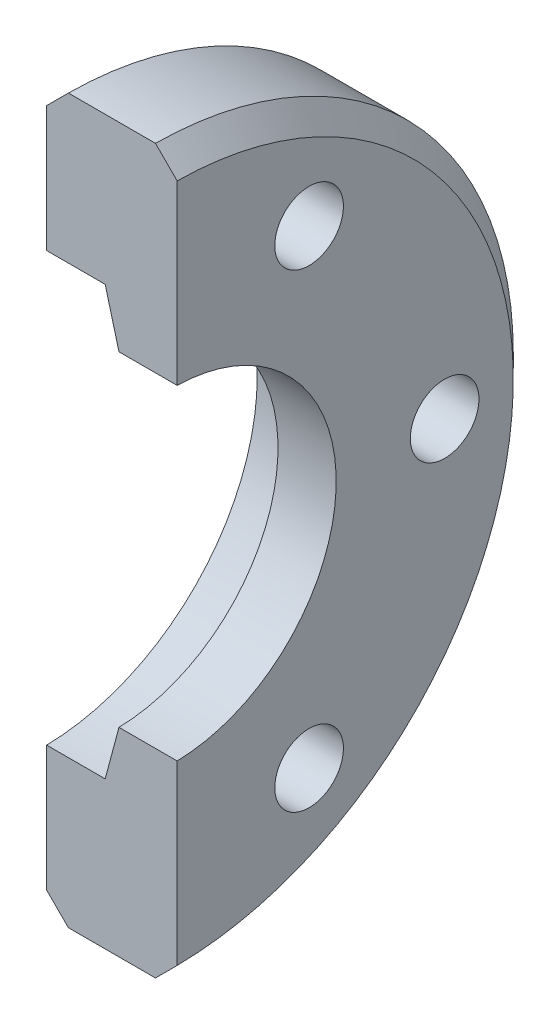
ISO-10303-21;
HEADER;
FILE_DESCRIPTION(('STEP AP214'),'2;1');
FILE_NAME('part.step','',(''),(''),'','','');
FILE_SCHEMA(('AUTOMOTIVE_DESIGN { 1 0 10303 214 1 1 1 1 }'));
ENDSEC;
DATA;
#1=APPLICATION_CONTEXT('core data for automotive mechanical design processes');
#2=APPLICATION_PROTOCOL_DEFINITION('international standard','automotive_design',2000,#1);
#3=PRODUCT_CONTEXT('',#1,'mechanical');
#4=PRODUCT('Part','Part','',(#3));
#5=PRODUCT_RELATED_PRODUCT_CATEGORY('part','',(#4));
#6=PRODUCT_DEFINITION_FORMATION('','',#4);
#7=PRODUCT_DEFINITION_CONTEXT('part definition',#1,'design');
#8=PRODUCT_DEFINITION('design','',#6,#7);
#9=PRODUCT_DEFINITION_SHAPE('','',#8);
#10=(LENGTH_UNIT() NAMED_UNIT(*) SI_UNIT(.MILLI.,.METRE.));
#11=(NAMED_UNIT(*) PLANE_ANGLE_UNIT() SI_UNIT($,.RADIAN.));
#12=(NAMED_UNIT(*) SI_UNIT($,.STERADIAN.) SOLID_ANGLE_UNIT());
#13=UNCERTAINTY_MEASURE_WITH_UNIT(LENGTH_MEASURE(1.E-05),#10,'distance_accuracy_value','');
#14=(GEOMETRIC_REPRESENTATION_CONTEXT(3) GLOBAL_UNCERTAINTY_ASSIGNED_CONTEXT((#13)) GLOBAL_UNIT_ASSIGNED_CONTEXT((#10,
#11,#12)) REPRESENTATION_CONTEXT('',''));
#15=CARTESIAN_POINT('',(0.,0.,0.));
#16=DIRECTION('',(0.,0.,1.));
#17=DIRECTION('',(1.,0.,0.));
#18=AXIS2_PLACEMENT_3D('',#15,#16,#17);
#19=CARTESIAN_POINT('',(0.,23.876,0.));
#20=DIRECTION('',(1.,0.,0.));
#21=DIRECTION('',(0.,0.,-1.));
#22=AXIS2_PLACEMENT_3D('',#19,#20,#21);
#23=PLANE('',#22);
#24=CARTESIAN_POINT('',(0.,0.,-19.05));
#25=DIRECTION('',(1.,0.,0.));
#26=DIRECTION('',(0.,1.,0.));
#27=AXIS2_PLACEMENT_3D('',#24,#25,#26);
#28=CIRCLE('',#27,2.413);
#29=CARTESIAN_POINT('',(0.,2.41299999999999,-19.05));
#30=VERTEX_POINT('',#29);
#31=EDGE_CURVE('E11',#30,#30,#28,.T.);
#32=ORIENTED_EDGE('',*,*,#31,.T.);
#33=EDGE_LOOP('',(#32));
#34=FACE_BOUND('',#33,.T.);
#35=CARTESIAN_POINT('',(0.,16.497783942094,-9.525));
#36=DIRECTION('',(1.,0.,0.));
#37=DIRECTION('',(0.,1.,0.));
#38=AXIS2_PLACEMENT_3D('',#35,#36,#37);
#39=CIRCLE('',#38,2.413);
#40=CARTESIAN_POINT('',(0.,18.910783942094,-9.525));
#41=VERTEX_POINT('',#40);
#42=EDGE_CURVE('E26',#41,#41,#39,.T.);
#43=ORIENTED_EDGE('',*,*,#42,.T.);
#44=EDGE_LOOP('',(#43));
#45=FACE_BOUND('',#44,.T.);
#46=CARTESIAN_POINT('',(0.,-16.497783942094,-9.525));
#47=DIRECTION('',(1.,0.,0.));
#48=DIRECTION('',(0.,1.,0.));
#49=AXIS2_PLACEMENT_3D('',#46,#47,#48);
#50=CIRCLE('',#49,2.413);
#51=CARTESIAN_POINT('',(0.,-14.084783942094,-9.525));
#52=VERTEX_POINT('',#51);
#53=EDGE_CURVE('E183',#52,#52,#50,.T.);
#54=ORIENTED_EDGE('',*,*,#53,.T.);
#55=EDGE_LOOP('',(#54));
#56=FACE_BOUND('',#55,.T.);
#57=DIRECTION('',(0.,-1.,0.));
#58=VECTOR('',#57,1.);
#59=CARTESIAN_POINT('',(0.,23.876,-0.254));
#60=LINE('',#59,#58);
#61=CARTESIAN_POINT('',(0.,23.8746488979419,-0.254));
#62=VERTEX_POINT('',#61);
#63=CARTESIAN_POINT('',(0.,15.047356387419,-0.254));
#64=VERTEX_POINT('',#63);
#65=EDGE_CURVE('E35',#62,#64,#60,.T.);
#66=ORIENTED_EDGE('',*,*,#65,.F.);
#67=CARTESIAN_POINT('',(0.,0.,0.));
#68=DIRECTION('',(-1.,0.,0.));
#69=DIRECTION('',(0.,0.,1.));
#70=AXIS2_PLACEMENT_3D('',#67,#68,#69);
#71=CIRCLE('',#70,23.876);
#72=CARTESIAN_POINT('',(0.,-23.8746488979419,-0.254));
#73=VERTEX_POINT('',#72);
#74=EDGE_CURVE('E124',#62,#73,#71,.T.);
#75=ORIENTED_EDGE('',*,*,#74,.T.);
#76=DIRECTION('',(0.,-1.,0.));
#77=VECTOR('',#76,1.);
#78=CARTESIAN_POINT('',(0.,23.876,-0.254));
#79=LINE('',#78,#77);
#80=CARTESIAN_POINT('',(0.,-15.047356387419,-0.254));
#81=VERTEX_POINT('',#80);
#82=EDGE_CURVE('E117',#81,#73,#79,.T.);
#83=ORIENTED_EDGE('',*,*,#82,.F.);
#84=CARTESIAN_POINT('',(0.,0.,0.));
#85=DIRECTION('',(-1.,0.,0.));
#86=DIRECTION('',(0.,0.,1.));
#87=AXIS2_PLACEMENT_3D('',#84,#85,#86);
#88=CIRCLE('',#87,15.0495);
#89=EDGE_CURVE('E126',#64,#81,#88,.T.);
#90=ORIENTED_EDGE('',*,*,#89,.F.);
#91=EDGE_LOOP('',(#66,#75,#83,#90));
#92=FACE_BOUND('',#91,.T.);
#93=ADVANCED_FACE('F16',(#34,#45,#56,#92),#23,.F.);
#94=CARTESIAN_POINT('',(-50.8,50.8,-0.254));
#95=DIRECTION('',(0.,0.,1.));
#96=DIRECTION('',(1.,0.,0.));
#97=AXIS2_PLACEMENT_3D('',#94,#95,#96);
#98=PLANE('',#97);
#99=DIRECTION('',(1.,0.,0.));
#100=VECTOR('',#99,1.);
#101=CARTESIAN_POINT('',(9.1694,15.047356387419,-0.254));
#102=LINE('',#101,#100);
#103=CARTESIAN_POINT('',(4.1101578979956,15.047356387419,-0.254));
#104=VERTEX_POINT('',#103);
#105=EDGE_CURVE('E131',#64,#104,#102,.T.);
#106=ORIENTED_EDGE('',*,*,#105,.T.);
#107=CARTESIAN_POINT('',(4.11015789799561,15.047356387419,-0.254));
#108=CARTESIAN_POINT('',(4.43345221536625,13.8406336866748,-0.254));
#109=CARTESIAN_POINT('',(4.75673722811473,12.6339085132271,-0.254));
#110=CARTESIAN_POINT('',(5.08,11.4271774292692,-0.254));
#111=B_SPLINE_CURVE_WITH_KNOTS('',3,(#107,#108,#109,#110),.UNSPECIFIED.,.F.,.F.,(4,4),
(0.0187084762179341,0.0224563066389064),.UNSPECIFIED.);
#112=CARTESIAN_POINT('',(5.08,11.4271774292692,-0.254));
#113=VERTEX_POINT('',#112);
#114=EDGE_CURVE('E134',#104,#113,#111,.T.);
#115=ORIENTED_EDGE('',*,*,#114,.T.);
#116=DIRECTION('',(1.,0.,0.));
#117=VECTOR('',#116,1.);
#118=CARTESIAN_POINT('',(9.1694,11.4271774292692,-0.254));
#119=LINE('',#118,#117);
#120=CARTESIAN_POINT('',(9.1694,11.4271774292692,-0.254));
#121=VERTEX_POINT('',#120);
#122=EDGE_CURVE('E139',#113,#121,#119,.T.);
#123=ORIENTED_EDGE('',*,*,#122,.T.);
#124=DIRECTION('',(0.,1.,0.));
#125=VECTOR('',#124,1.);
#126=CARTESIAN_POINT('',(9.1694,11.43,-0.254));
#127=LINE('',#126,#125);
#128=CARTESIAN_POINT('',(9.1694,23.8746488979419,-0.254));
#129=VERTEX_POINT('',#128);
#130=EDGE_CURVE('E114',#121,#129,#127,.T.);
#131=ORIENTED_EDGE('',*,*,#130,.T.);
#132=DIRECTION('',(-0.707086773354906,0.707126788452077,0.));
#133=VECTOR('',#132,1.);
#134=CARTESIAN_POINT('',(8.40740062748683,24.6366900605401,-0.254));
#135=LINE('',#134,#133);
#136=CARTESIAN_POINT('',(7.6454,25.3987299682484,-0.254));
#137=VERTEX_POINT('',#136);
#138=EDGE_CURVE('E112',#129,#137,#135,.T.);
#139=ORIENTED_EDGE('',*,*,#138,.T.);
#140=DIRECTION('',(-1.,0.,0.));
#141=VECTOR('',#140,1.);
#142=CARTESIAN_POINT('',(9.1694,25.3987299682484,-0.254));
#143=LINE('',#142,#141);
#144=CARTESIAN_POINT('',(1.524,25.3987299682484,-0.254));
#145=VERTEX_POINT('',#144);
#146=EDGE_CURVE('E102',#137,#145,#143,.T.);
#147=ORIENTED_EDGE('',*,*,#146,.T.);
#148=DIRECTION('',(-0.707089102412087,-0.707124459519022,0.));
#149=VECTOR('',#148,1.);
#150=CARTESIAN_POINT('',(0.761999372515258,24.6366900605422,-0.254));
#151=LINE('',#150,#149);
#152=EDGE_CURVE('E115',#145,#62,#151,.T.);
#153=ORIENTED_EDGE('',*,*,#152,.T.);
#154=ORIENTED_EDGE('',*,*,#65,.T.);
#155=EDGE_LOOP('',(#106,#115,#123,#131,#139,#147,#153,#154));
#156=FACE_BOUND('',#155,.T.);
#157=ADVANCED_FACE('F181',(#156),#98,.T.);
#158=CARTESIAN_POINT('',(4.1101578979956,0.,0.));
#159=DIRECTION('',(-1.,0.,0.));
#160=DIRECTION('',(0.,0.,1.));
#161=AXIS2_PLACEMENT_3D('',#158,#159,#160);
#162=CONICAL_SURFACE('',#161,15.0495,1.30899693899576);
#163=ORIENTED_EDGE('',*,*,#114,.F.);
#164=CARTESIAN_POINT('',(4.1101578979956,0.,0.));
#165=DIRECTION('',(-1.,0.,0.));
#166=DIRECTION('',(0.,0.,1.));
#167=AXIS2_PLACEMENT_3D('',#164,#165,#166);
#168=CIRCLE('',#167,15.0495);
#169=CARTESIAN_POINT('',(4.1101578979956,-15.047356387419,-0.254));
#170=VERTEX_POINT('',#169);
#171=EDGE_CURVE('E129',#104,#170,#168,.T.);
#172=ORIENTED_EDGE('',*,*,#171,.T.);
#173=CARTESIAN_POINT('',(5.08,-11.4271774292692,-0.254));
#174=CARTESIAN_POINT('',(4.75673722679854,-12.6339085181404,-0.254));
#175=CARTESIAN_POINT('',(4.43345221436652,-13.8406336904064,-0.254));
#176=CARTESIAN_POINT('',(4.11015789799561,-15.047356387419,-0.254));
#177=B_SPLINE_CURVE_WITH_KNOTS('',3,(#173,#174,#175,#176),.UNSPECIFIED.,.F.,.F.,(4,4),
(0.0459629505750064,0.0496729072252077),.UNSPECIFIED.);
#178=CARTESIAN_POINT('',(5.08,-11.4271774292692,-0.254));
#179=VERTEX_POINT('',#178);
#180=EDGE_CURVE('E150',#179,#170,#177,.T.);
#181=ORIENTED_EDGE('',*,*,#180,.F.);
#182=CARTESIAN_POINT('',(5.08,0.,0.));
#183=DIRECTION('',(-1.,0.,0.));
#184=DIRECTION('',(0.,0.,1.));
#185=AXIS2_PLACEMENT_3D('',#182,#183,#184);
#186=CIRCLE('',#185,11.43);
#187=EDGE_CURVE('E120',#113,#179,#186,.T.);
#188=ORIENTED_EDGE('',*,*,#187,.F.);
#189=EDGE_LOOP('',(#163,#172,#181,#188));
#190=FACE_BOUND('',#189,.T.);
#191=ADVANCED_FACE('F174',(#190),#162,.F.);
#192=CARTESIAN_POINT('',(9.1694,0.,0.));
#193=DIRECTION('',(1.,0.,0.));
#194=DIRECTION('',(0.,0.,1.));
#195=AXIS2_PLACEMENT_3D('',#192,#193,#194);
#196=CYLINDRICAL_SURFACE('',#195,15.0495);
#197=ORIENTED_EDGE('',*,*,#105,.F.);
#198=ORIENTED_EDGE('',*,*,#89,.T.);
#199=DIRECTION('',(-1.,0.,0.));
#200=VECTOR('',#199,1.);
#201=CARTESIAN_POINT('',(9.1694,-15.047356387419,-0.254));
#202=LINE('',#201,#200);
#203=EDGE_CURVE('E118',#170,#81,#202,.T.);
#204=ORIENTED_EDGE('',*,*,#203,.F.);
#205=ORIENTED_EDGE('',*,*,#171,.F.);
#206=EDGE_LOOP('',(#197,#198,#204,#205));
#207=FACE_BOUND('',#206,.T.);
#208=ADVANCED_FACE('F179',(#207),#196,.F.);
#209=CARTESIAN_POINT('',(1.524,0.,0.));
#210=DIRECTION('',(1.,0.,0.));
#211=DIRECTION('',(0.,0.,-1.));
#212=AXIS2_PLACEMENT_3D('',#209,#210,#211);
#213=CONICAL_SURFACE('',#212,25.4,0.785398163397448);
#214=ORIENTED_EDGE('',*,*,#152,.F.);
#215=CARTESIAN_POINT('',(1.524,0.,0.));
#216=DIRECTION('',(-1.,0.,0.));
#217=DIRECTION('',(0.,0.,1.));
#218=AXIS2_PLACEMENT_3D('',#215,#216,#217);
#219=CIRCLE('',#218,25.4);
#220=CARTESIAN_POINT('',(1.524,-25.3987299682484,-0.254));
#221=VERTEX_POINT('',#220);
#222=EDGE_CURVE('E130',#145,#221,#219,.T.);
#223=ORIENTED_EDGE('',*,*,#222,.T.);
#224=DIRECTION('',(0.707086773354903,-0.70712678845208,0.));
#225=VECTOR('',#224,1.);
#226=CARTESIAN_POINT('',(0.761999372513166,-24.6366900605401,-0.254));
#227=LINE('',#226,#225);
#228=EDGE_CURVE('E95',#73,#221,#227,.T.);
#229=ORIENTED_EDGE('',*,*,#228,.F.);
#230=ORIENTED_EDGE('',*,*,#74,.F.);
#231=EDGE_LOOP('',(#214,#223,#229,#230));
#232=FACE_BOUND('',#231,.T.);
#233=ADVANCED_FACE('F216',(#232),#213,.T.);
#234=CARTESIAN_POINT('',(9.1694,11.43,0.));
#235=DIRECTION('',(-1.,0.,0.));
#236=DIRECTION('',(0.,0.,1.));
#237=AXIS2_PLACEMENT_3D('',#234,#235,#236);
#238=PLANE('',#237);
#239=CARTESIAN_POINT('',(9.1694,0.,-19.05));
#240=DIRECTION('',(1.,0.,0.));
#241=DIRECTION('',(0.,1.,0.));
#242=AXIS2_PLACEMENT_3D('',#239,#240,#241);
#243=CIRCLE('',#242,2.413);
#244=CARTESIAN_POINT('',(9.1694,2.41299999999999,-19.05));
#245=VERTEX_POINT('',#244);
#246=EDGE_CURVE('E107',#245,#245,#243,.T.);
#247=ORIENTED_EDGE('',*,*,#246,.F.);
#248=EDGE_LOOP('',(#247));
#249=FACE_BOUND('',#248,.T.);
#250=CARTESIAN_POINT('',(9.1694,16.497783942094,-9.525));
#251=DIRECTION('',(1.,0.,0.));
#252=DIRECTION('',(0.,1.,0.));
#253=AXIS2_PLACEMENT_3D('',#250,#251,#252);
#254=CIRCLE('',#253,2.413);
#255=CARTESIAN_POINT('',(9.1694,18.910783942094,-9.525));
#256=VERTEX_POINT('',#255);
#257=EDGE_CURVE('E104',#256,#256,#254,.T.);
#258=ORIENTED_EDGE('',*,*,#257,.F.);
#259=EDGE_LOOP('',(#258));
#260=FACE_BOUND('',#259,.T.);
#261=CARTESIAN_POINT('',(9.1694,-16.497783942094,-9.525));
#262=DIRECTION('',(1.,0.,0.));
#263=DIRECTION('',(0.,1.,0.));
#264=AXIS2_PLACEMENT_3D('',#261,#262,#263);
#265=CIRCLE('',#264,2.413);
#266=CARTESIAN_POINT('',(9.1694,-14.084783942094,-9.525));
#267=VERTEX_POINT('',#266);
#268=EDGE_CURVE('E155',#267,#267,#265,.T.);
#269=ORIENTED_EDGE('',*,*,#268,.F.);
#270=EDGE_LOOP('',(#269));
#271=FACE_BOUND('',#270,.T.);
#272=DIRECTION('',(0.,1.,0.));
#273=VECTOR('',#272,1.);
#274=CARTESIAN_POINT('',(9.1694,11.43,-0.254));
#275=LINE('',#274,#273);
#276=CARTESIAN_POINT('',(9.1694,-23.8746488979419,-0.254));
#277=VERTEX_POINT('',#276);
#278=CARTESIAN_POINT('',(9.1694,-11.4271774292692,-0.254));
#279=VERTEX_POINT('',#278);
#280=EDGE_CURVE('E80',#277,#279,#275,.T.);
#281=ORIENTED_EDGE('',*,*,#280,.F.);
#282=CARTESIAN_POINT('',(9.1694,0.,0.));
#283=DIRECTION('',(-1.,0.,0.));
#284=DIRECTION('',(0.,0.,1.));
#285=AXIS2_PLACEMENT_3D('',#282,#283,#284);
#286=CIRCLE('',#285,23.876);
#287=EDGE_CURVE('E89',#129,#277,#286,.T.);
#288=ORIENTED_EDGE('',*,*,#287,.F.);
#289=ORIENTED_EDGE('',*,*,#130,.F.);
#290=CARTESIAN_POINT('',(9.1694,0.,0.));
#291=DIRECTION('',(-1.,0.,0.));
#292=DIRECTION('',(0.,0.,1.));
#293=AXIS2_PLACEMENT_3D('',#290,#291,#292);
#294=CIRCLE('',#293,11.43);
#295=EDGE_CURVE('E160',#121,#279,#294,.T.);
#296=ORIENTED_EDGE('',*,*,#295,.T.);
#297=EDGE_LOOP('',(#281,#288,#289,#296));
#298=FACE_BOUND('',#297,.T.);
#299=ADVANCED_FACE('F219',(#249,#260,#271,#298),#238,.F.);
#300=CARTESIAN_POINT('',(9.1694,0.,0.));
#301=DIRECTION('',(1.,0.,0.));
#302=DIRECTION('',(0.,0.,1.));
#303=AXIS2_PLACEMENT_3D('',#300,#301,#302);
#304=CYLINDRICAL_SURFACE('',#303,11.43);
#305=ORIENTED_EDGE('',*,*,#122,.F.);
#306=ORIENTED_EDGE('',*,*,#187,.T.);
#307=DIRECTION('',(-1.,0.,0.));
#308=VECTOR('',#307,1.);
#309=CARTESIAN_POINT('',(9.1694,-11.4271774292692,-0.254));
#310=LINE('',#309,#308);
#311=EDGE_CURVE('E154',#279,#179,#310,.T.);
#312=ORIENTED_EDGE('',*,*,#311,.F.);
#313=ORIENTED_EDGE('',*,*,#295,.F.);
#314=EDGE_LOOP('',(#305,#306,#312,#313));
#315=FACE_BOUND('',#314,.T.);
#316=ADVANCED_FACE('F171',(#315),#304,.F.);
#317=CARTESIAN_POINT('',(-50.8,50.8,-0.254));
#318=DIRECTION('',(0.,0.,1.));
#319=DIRECTION('',(1.,0.,0.));
#320=AXIS2_PLACEMENT_3D('',#317,#318,#319);
#321=PLANE('',#320);
#322=ORIENTED_EDGE('',*,*,#203,.T.);
#323=ORIENTED_EDGE('',*,*,#82,.T.);
#324=ORIENTED_EDGE('',*,*,#228,.T.);
#325=DIRECTION('',(1.,0.,0.));
#326=VECTOR('',#325,1.);
#327=CARTESIAN_POINT('',(9.1694,-25.3987299682484,-0.254));
#328=LINE('',#327,#326);
#329=CARTESIAN_POINT('',(7.6454,-25.3987299682484,-0.254));
#330=VERTEX_POINT('',#329);
#331=EDGE_CURVE('E90',#221,#330,#328,.T.);
#332=ORIENTED_EDGE('',*,*,#331,.T.);
#333=DIRECTION('',(0.707089102412087,0.707124459519022,0.));
#334=VECTOR('',#333,1.);
#335=CARTESIAN_POINT('',(8.40740062748475,-24.6366900605421,-0.254));
#336=LINE('',#335,#334);
#337=EDGE_CURVE('E20',#330,#277,#336,.T.);
#338=ORIENTED_EDGE('',*,*,#337,.T.);
#339=ORIENTED_EDGE('',*,*,#280,.T.);
#340=ORIENTED_EDGE('',*,*,#311,.T.);
#341=ORIENTED_EDGE('',*,*,#180,.T.);
#342=EDGE_LOOP('',(#322,#323,#324,#332,#338,#339,#340,#341));
#343=FACE_BOUND('',#342,.T.);
#344=ADVANCED_FACE('F93',(#343),#321,.T.);
#345=CARTESIAN_POINT('',(9.1694,-16.497783942094,-9.525));
#346=DIRECTION('',(1.,0.,0.));
#347=DIRECTION('',(0.,0.,1.));
#348=AXIS2_PLACEMENT_3D('',#345,#346,#347);
#349=CYLINDRICAL_SURFACE('',#348,2.413);
#350=ORIENTED_EDGE('',*,*,#268,.T.);
#351=EDGE_LOOP('',(#350));
#352=FACE_BOUND('',#351,.T.);
#353=ORIENTED_EDGE('',*,*,#53,.F.);
#354=EDGE_LOOP('',(#353));
#355=FACE_BOUND('',#354,.T.);
#356=ADVANCED_FACE('F201',(#352,#355),#349,.F.);
#357=CARTESIAN_POINT('',(9.1694,0.,-19.05));
#358=DIRECTION('',(1.,0.,0.));
#359=DIRECTION('',(0.,0.,1.));
#360=AXIS2_PLACEMENT_3D('',#357,#358,#359);
#361=CYLINDRICAL_SURFACE('',#360,2.413);
#362=ORIENTED_EDGE('',*,*,#246,.T.);
#363=EDGE_LOOP('',(#362));
#364=FACE_BOUND('',#363,.T.);
#365=ORIENTED_EDGE('',*,*,#31,.F.);
#366=EDGE_LOOP('',(#365));
#367=FACE_BOUND('',#366,.T.);
#368=ADVANCED_FACE('F193',(#364,#367),#361,.F.);
#369=CARTESIAN_POINT('',(9.1694,16.497783942094,-9.525));
#370=DIRECTION('',(1.,0.,0.));
#371=DIRECTION('',(0.,0.,1.));
#372=AXIS2_PLACEMENT_3D('',#369,#370,#371);
#373=CYLINDRICAL_SURFACE('',#372,2.413);
#374=ORIENTED_EDGE('',*,*,#257,.T.);
#375=EDGE_LOOP('',(#374));
#376=FACE_BOUND('',#375,.T.);
#377=ORIENTED_EDGE('',*,*,#42,.F.);
#378=EDGE_LOOP('',(#377));
#379=FACE_BOUND('',#378,.T.);
#380=ADVANCED_FACE('F191',(#376,#379),#373,.F.);
#381=CARTESIAN_POINT('',(9.1694,0.,0.));
#382=DIRECTION('',(1.,0.,0.));
#383=DIRECTION('',(0.,0.,1.));
#384=AXIS2_PLACEMENT_3D('',#381,#382,#383);
#385=CYLINDRICAL_SURFACE('',#384,25.4);
#386=ORIENTED_EDGE('',*,*,#146,.F.);
#387=CARTESIAN_POINT('',(7.6454,0.,0.));
#388=DIRECTION('',(-1.,0.,0.));
#389=DIRECTION('',(0.,0.,1.));
#390=AXIS2_PLACEMENT_3D('',#387,#388,#389);
#391=CIRCLE('',#390,25.4);
#392=EDGE_CURVE('E87',#137,#330,#391,.T.);
#393=ORIENTED_EDGE('',*,*,#392,.T.);
#394=ORIENTED_EDGE('',*,*,#331,.F.);
#395=ORIENTED_EDGE('',*,*,#222,.F.);
#396=EDGE_LOOP('',(#386,#393,#394,#395));
#397=FACE_BOUND('',#396,.T.);
#398=ADVANCED_FACE('F100',(#397),#385,.T.);
#399=CARTESIAN_POINT('',(9.1694,0.,0.));
#400=DIRECTION('',(-1.,0.,0.));
#401=DIRECTION('',(0.,0.,1.));
#402=AXIS2_PLACEMENT_3D('',#399,#400,#401);
#403=CONICAL_SURFACE('',#402,23.876,0.785398163397448);
#404=ORIENTED_EDGE('',*,*,#337,.F.);
#405=ORIENTED_EDGE('',*,*,#392,.F.);
#406=ORIENTED_EDGE('',*,*,#138,.F.);
#407=ORIENTED_EDGE('',*,*,#287,.T.);
#408=EDGE_LOOP('',(#404,#405,#406,#407));
#409=FACE_BOUND('',#408,.T.);
#410=ADVANCED_FACE('F18',(#409),#403,.T.);
#411=CLOSED_SHELL('',(#93,#157,#191,#208,#233,#299,#316,#344,#356,#368,#380,#398,#410));
#412=MANIFOLD_SOLID_BREP('B1',#411);
#413=ADVANCED_BREP_SHAPE_REPRESENTATION('',(#18,#412),#14);
#414=SHAPE_DEFINITION_REPRESENTATION(#9,#413);
ENDSEC;
END-ISO-10303-21;
